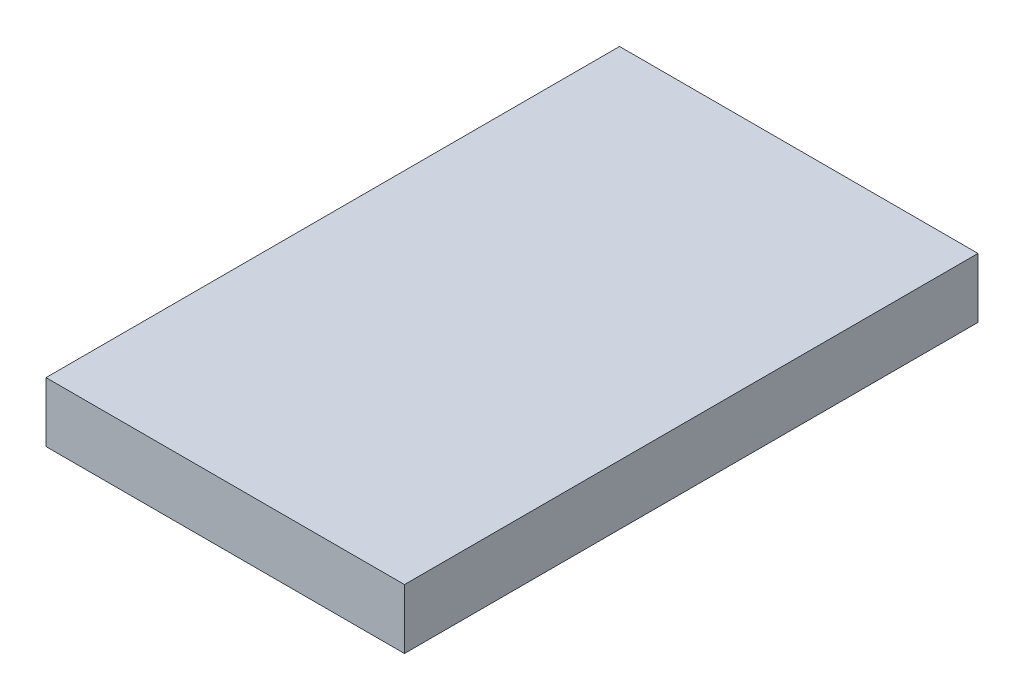
ISO-10303-21;
HEADER;
FILE_DESCRIPTION(('STEP AP214'),'2;1');
FILE_NAME('part.step','',(''),(''),'','','');
FILE_SCHEMA(('AUTOMOTIVE_DESIGN { 1 0 10303 214 1 1 1 1 }'));
ENDSEC;
DATA;
#1=APPLICATION_CONTEXT('core data for automotive mechanical design processes');
#2=APPLICATION_PROTOCOL_DEFINITION('international standard','automotive_design',2000,#1);
#3=PRODUCT_CONTEXT('',#1,'mechanical');
#4=PRODUCT('Part','Part','',(#3));
#5=PRODUCT_RELATED_PRODUCT_CATEGORY('part','',(#4));
#6=PRODUCT_DEFINITION_FORMATION('','',#4);
#7=PRODUCT_DEFINITION_CONTEXT('part definition',#1,'design');
#8=PRODUCT_DEFINITION('design','',#6,#7);
#9=PRODUCT_DEFINITION_SHAPE('','',#8);
#10=(LENGTH_UNIT() NAMED_UNIT(*) SI_UNIT(.MILLI.,.METRE.));
#11=(NAMED_UNIT(*) PLANE_ANGLE_UNIT() SI_UNIT($,.RADIAN.));
#12=(NAMED_UNIT(*) SI_UNIT($,.STERADIAN.) SOLID_ANGLE_UNIT());
#13=UNCERTAINTY_MEASURE_WITH_UNIT(LENGTH_MEASURE(1.E-05),#10,'distance_accuracy_value','');
#14=(GEOMETRIC_REPRESENTATION_CONTEXT(3) GLOBAL_UNCERTAINTY_ASSIGNED_CONTEXT((#13)) GLOBAL_UNIT_ASSIGNED_CONTEXT((#10,
#11,#12)) REPRESENTATION_CONTEXT('',''));
#15=CARTESIAN_POINT('',(0.,0.,0.));
#16=DIRECTION('',(0.,0.,1.));
#17=DIRECTION('',(1.,0.,0.));
#18=AXIS2_PLACEMENT_3D('',#15,#16,#17);
#19=CARTESIAN_POINT('',(9.525,3.175,15.24));
#20=DIRECTION('',(-1.,0.,0.));
#21=DIRECTION('',(0.,0.,1.));
#22=AXIS2_PLACEMENT_3D('',#19,#20,#21);
#23=PLANE('',#22);
#24=DIRECTION('',(0.,0.,-1.));
#25=VECTOR('',#24,1.);
#26=CARTESIAN_POINT('',(9.525,0.,15.24));
#27=LINE('',#26,#25);
#28=CARTESIAN_POINT('',(9.525,0.,15.24));
#29=VERTEX_POINT('',#28);
#30=CARTESIAN_POINT('',(9.525,0.,-15.24));
#31=VERTEX_POINT('',#30);
#32=EDGE_CURVE('E96',#29,#31,#27,.T.);
#33=ORIENTED_EDGE('',*,*,#32,.T.);
#34=DIRECTION('',(0.,-1.,0.));
#35=VECTOR('',#34,1.);
#36=CARTESIAN_POINT('',(9.525,3.175,-15.24));
#37=LINE('',#36,#35);
#38=CARTESIAN_POINT('',(9.525,3.175,-15.24));
#39=VERTEX_POINT('',#38);
#40=EDGE_CURVE('E11',#39,#31,#37,.T.);
#41=ORIENTED_EDGE('',*,*,#40,.F.);
#42=DIRECTION('',(0.,0.,-1.));
#43=VECTOR('',#42,1.);
#44=CARTESIAN_POINT('',(9.525,3.175,15.24));
#45=LINE('',#44,#43);
#46=CARTESIAN_POINT('',(9.525,3.175,15.24));
#47=VERTEX_POINT('',#46);
#48=EDGE_CURVE('E84',#47,#39,#45,.T.);
#49=ORIENTED_EDGE('',*,*,#48,.F.);
#50=DIRECTION('',(0.,-1.,0.));
#51=VECTOR('',#50,1.);
#52=CARTESIAN_POINT('',(9.525,3.175,15.24));
#53=LINE('',#52,#51);
#54=EDGE_CURVE('E92',#47,#29,#53,.T.);
#55=ORIENTED_EDGE('',*,*,#54,.T.);
#56=EDGE_LOOP('',(#33,#41,#49,#55));
#57=FACE_BOUND('',#56,.T.);
#58=ADVANCED_FACE('F33',(#57),#23,.F.);
#59=CARTESIAN_POINT('',(-9.525,3.175,-15.24));
#60=DIRECTION('',(0.,0.,1.));
#61=DIRECTION('',(1.,0.,0.));
#62=AXIS2_PLACEMENT_3D('',#59,#60,#61);
#63=PLANE('',#62);
#64=DIRECTION('',(-1.,0.,0.));
#65=VECTOR('',#64,1.);
#66=CARTESIAN_POINT('',(-9.525,0.,-15.24));
#67=LINE('',#66,#65);
#68=CARTESIAN_POINT('',(-9.525,0.,-15.24));
#69=VERTEX_POINT('',#68);
#70=EDGE_CURVE('E88',#31,#69,#67,.T.);
#71=ORIENTED_EDGE('',*,*,#70,.T.);
#72=DIRECTION('',(0.,-1.,0.));
#73=VECTOR('',#72,1.);
#74=CARTESIAN_POINT('',(-9.525,3.175,-15.24));
#75=LINE('',#74,#73);
#76=CARTESIAN_POINT('',(-9.525,3.175,-15.24));
#77=VERTEX_POINT('',#76);
#78=EDGE_CURVE('E41',#77,#69,#75,.T.);
#79=ORIENTED_EDGE('',*,*,#78,.F.);
#80=DIRECTION('',(-1.,0.,0.));
#81=VECTOR('',#80,1.);
#82=CARTESIAN_POINT('',(-9.525,3.175,-15.24));
#83=LINE('',#82,#81);
#84=EDGE_CURVE('E79',#39,#77,#83,.T.);
#85=ORIENTED_EDGE('',*,*,#84,.F.);
#86=ORIENTED_EDGE('',*,*,#40,.T.);
#87=EDGE_LOOP('',(#71,#79,#85,#86));
#88=FACE_BOUND('',#87,.T.);
#89=ADVANCED_FACE('F87',(#88),#63,.F.);
#90=CARTESIAN_POINT('',(-9.525,3.175,15.24));
#91=DIRECTION('',(1.,0.,0.));
#92=DIRECTION('',(0.,0.,-1.));
#93=AXIS2_PLACEMENT_3D('',#90,#91,#92);
#94=PLANE('',#93);
#95=DIRECTION('',(0.,0.,1.));
#96=VECTOR('',#95,1.);
#97=CARTESIAN_POINT('',(-9.525,0.,15.24));
#98=LINE('',#97,#96);
#99=CARTESIAN_POINT('',(-9.525,0.,15.24));
#100=VERTEX_POINT('',#99);
#101=EDGE_CURVE('E66',#69,#100,#98,.T.);
#102=ORIENTED_EDGE('',*,*,#101,.T.);
#103=DIRECTION('',(0.,-1.,0.));
#104=VECTOR('',#103,1.);
#105=CARTESIAN_POINT('',(-9.525,3.175,15.24));
#106=LINE('',#105,#104);
#107=CARTESIAN_POINT('',(-9.525,3.175,15.24));
#108=VERTEX_POINT('',#107);
#109=EDGE_CURVE('E89',#108,#100,#106,.T.);
#110=ORIENTED_EDGE('',*,*,#109,.F.);
#111=DIRECTION('',(0.,0.,1.));
#112=VECTOR('',#111,1.);
#113=CARTESIAN_POINT('',(-9.525,3.175,15.24));
#114=LINE('',#113,#112);
#115=EDGE_CURVE('E82',#77,#108,#114,.T.);
#116=ORIENTED_EDGE('',*,*,#115,.F.);
#117=ORIENTED_EDGE('',*,*,#78,.T.);
#118=EDGE_LOOP('',(#102,#110,#116,#117));
#119=FACE_BOUND('',#118,.T.);
#120=ADVANCED_FACE('F90',(#119),#94,.F.);
#121=CARTESIAN_POINT('',(-9.525,3.175,15.24));
#122=DIRECTION('',(0.,0.,-1.));
#123=DIRECTION('',(-1.,0.,0.));
#124=AXIS2_PLACEMENT_3D('',#121,#122,#123);
#125=PLANE('',#124);
#126=DIRECTION('',(1.,0.,0.));
#127=VECTOR('',#126,1.);
#128=CARTESIAN_POINT('',(-9.525,0.,15.24));
#129=LINE('',#128,#127);
#130=EDGE_CURVE('E72',#100,#29,#129,.T.);
#131=ORIENTED_EDGE('',*,*,#130,.T.);
#132=ORIENTED_EDGE('',*,*,#54,.F.);
#133=DIRECTION('',(1.,0.,0.));
#134=VECTOR('',#133,1.);
#135=CARTESIAN_POINT('',(-9.525,3.175,15.24));
#136=LINE('',#135,#134);
#137=EDGE_CURVE('E49',#108,#47,#136,.T.);
#138=ORIENTED_EDGE('',*,*,#137,.F.);
#139=ORIENTED_EDGE('',*,*,#109,.T.);
#140=EDGE_LOOP('',(#131,#132,#138,#139));
#141=FACE_BOUND('',#140,.T.);
#142=ADVANCED_FACE('F103',(#141),#125,.F.);
#143=CARTESIAN_POINT('',(0.,3.175,0.));
#144=DIRECTION('',(0.,-1.,0.));
#145=DIRECTION('',(0.,0.,-1.));
#146=AXIS2_PLACEMENT_3D('',#143,#144,#145);
#147=PLANE('',#146);
#148=ORIENTED_EDGE('',*,*,#48,.T.);
#149=ORIENTED_EDGE('',*,*,#84,.T.);
#150=ORIENTED_EDGE('',*,*,#115,.T.);
#151=ORIENTED_EDGE('',*,*,#137,.T.);
#152=EDGE_LOOP('',(#148,#149,#150,#151));
#153=FACE_BOUND('',#152,.T.);
#154=ADVANCED_FACE('F80',(#153),#147,.F.);
#155=CARTESIAN_POINT('',(0.,0.,0.));
#156=DIRECTION('',(0.,-1.,0.));
#157=DIRECTION('',(0.,0.,-1.));
#158=AXIS2_PLACEMENT_3D('',#155,#156,#157);
#159=PLANE('',#158);
#160=ORIENTED_EDGE('',*,*,#32,.F.);
#161=ORIENTED_EDGE('',*,*,#130,.F.);
#162=ORIENTED_EDGE('',*,*,#101,.F.);
#163=ORIENTED_EDGE('',*,*,#70,.F.);
#164=EDGE_LOOP('',(#160,#161,#162,#163));
#165=FACE_BOUND('',#164,.T.);
#166=ADVANCED_FACE('F106',(#165),#159,.T.);
#167=CLOSED_SHELL('',(#58,#89,#120,#142,#154,#166));
#168=MANIFOLD_SOLID_BREP('B2',#167);
#169=ADVANCED_BREP_SHAPE_REPRESENTATION('',(#18,#168),#14);
#170=SHAPE_DEFINITION_REPRESENTATION(#9,#169);
ENDSEC;
END-ISO-10303-21;
